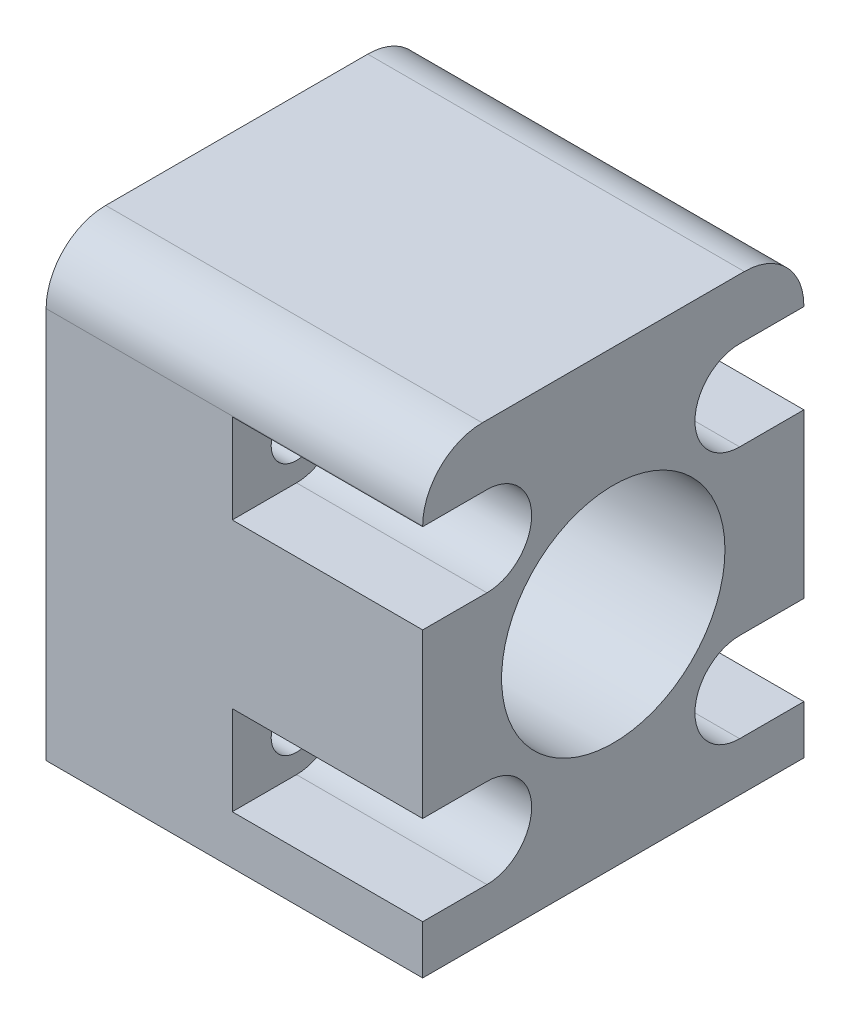
ISO-10303-21;
HEADER;
FILE_DESCRIPTION(('STEP AP214'),'2;1');
FILE_NAME('part.step','',(''),(''),'','','');
FILE_SCHEMA(('AUTOMOTIVE_DESIGN { 1 0 10303 214 1 1 1 1 }'));
ENDSEC;
DATA;
#1=APPLICATION_CONTEXT('core data for automotive mechanical design processes');
#2=APPLICATION_PROTOCOL_DEFINITION('international standard','automotive_design',2000,#1);
#3=PRODUCT_CONTEXT('',#1,'mechanical');
#4=PRODUCT('Part','Part','',(#3));
#5=PRODUCT_RELATED_PRODUCT_CATEGORY('part','',(#4));
#6=PRODUCT_DEFINITION_FORMATION('','',#4);
#7=PRODUCT_DEFINITION_CONTEXT('part definition',#1,'design');
#8=PRODUCT_DEFINITION('design','',#6,#7);
#9=PRODUCT_DEFINITION_SHAPE('','',#8);
#10=(LENGTH_UNIT() NAMED_UNIT(*) SI_UNIT(.MILLI.,.METRE.));
#11=(NAMED_UNIT(*) PLANE_ANGLE_UNIT() SI_UNIT($,.RADIAN.));
#12=(NAMED_UNIT(*) SI_UNIT($,.STERADIAN.) SOLID_ANGLE_UNIT());
#13=UNCERTAINTY_MEASURE_WITH_UNIT(LENGTH_MEASURE(1.E-05),#10,'distance_accuracy_value','');
#14=(GEOMETRIC_REPRESENTATION_CONTEXT(3) GLOBAL_UNCERTAINTY_ASSIGNED_CONTEXT((#13)) GLOBAL_UNIT_ASSIGNED_CONTEXT((#10,
#11,#12)) REPRESENTATION_CONTEXT('',''));
#15=CARTESIAN_POINT('',(0.,0.,0.));
#16=DIRECTION('',(0.,0.,1.));
#17=DIRECTION('',(1.,0.,0.));
#18=AXIS2_PLACEMENT_3D('',#15,#16,#17);
#19=CARTESIAN_POINT('',(0.,0.,25.6));
#20=DIRECTION('',(0.,0.,1.));
#21=DIRECTION('',(1.,0.,0.));
#22=AXIS2_PLACEMENT_3D('',#19,#20,#21);
#23=PLANE('',#22);
#24=DIRECTION('',(1.,0.,0.));
#25=VECTOR('',#24,1.);
#26=CARTESIAN_POINT('',(0.,-28.1822116803919,25.6));
#27=LINE('',#26,#25);
#28=CARTESIAN_POINT('',(61.7669675202535,-28.1822116803919,25.6));
#29=VERTEX_POINT('',#28);
#30=CARTESIAN_POINT('',(87.0552799456925,-28.1822116803919,25.6));
#31=VERTEX_POINT('',#30);
#32=EDGE_CURVE('E201',#29,#31,#27,.T.);
#33=ORIENTED_EDGE('',*,*,#32,.T.);
#34=DIRECTION('',(0.,1.,0.));
#35=VECTOR('',#34,1.);
#36=CARTESIAN_POINT('',(87.0552799456925,0.,25.6));
#37=LINE('',#36,#35);
#38=CARTESIAN_POINT('',(87.0552799456925,-24.9074927035347,25.6));
#39=VERTEX_POINT('',#38);
#40=EDGE_CURVE('E47',#31,#39,#37,.T.);
#41=ORIENTED_EDGE('',*,*,#40,.T.);
#42=DIRECTION('',(-1.,0.,0.));
#43=VECTOR('',#42,1.);
#44=CARTESIAN_POINT('',(0.,-24.9074927035347,25.6));
#45=LINE('',#44,#43);
#46=CARTESIAN_POINT('',(74.2669675202535,-24.9074927035347,25.6));
#47=VERTEX_POINT('',#46);
#48=EDGE_CURVE('E352',#39,#47,#45,.T.);
#49=ORIENTED_EDGE('',*,*,#48,.T.);
#50=DIRECTION('',(0.,-1.,0.));
#51=VECTOR('',#50,1.);
#52=CARTESIAN_POINT('',(74.2669675202535,0.,25.6));
#53=LINE('',#52,#51);
#54=CARTESIAN_POINT('',(74.2669675202535,-18.9074927035347,25.6));
#55=VERTEX_POINT('',#54);
#56=EDGE_CURVE('E259',#55,#47,#53,.T.);
#57=ORIENTED_EDGE('',*,*,#56,.F.);
#58=DIRECTION('',(1.,0.,0.));
#59=VECTOR('',#58,1.);
#60=CARTESIAN_POINT('',(0.,-18.9074927035347,25.6));
#61=LINE('',#60,#59);
#62=CARTESIAN_POINT('',(87.0552799456925,-18.9074927035347,25.6));
#63=VERTEX_POINT('',#62);
#64=EDGE_CURVE('E347',#55,#63,#61,.T.);
#65=ORIENTED_EDGE('',*,*,#64,.T.);
#66=CARTESIAN_POINT('',(87.0552799456925,-7.93692995505755,25.6));
#67=VERTEX_POINT('',#66);
#68=EDGE_CURVE('E401',#63,#67,#37,.T.);
#69=ORIENTED_EDGE('',*,*,#68,.T.);
#70=DIRECTION('',(-1.,0.,0.));
#71=VECTOR('',#70,1.);
#72=CARTESIAN_POINT('',(0.,-7.93692995505755,25.6));
#73=LINE('',#72,#71);
#74=CARTESIAN_POINT('',(74.2669675202535,-7.93692995505755,25.6));
#75=VERTEX_POINT('',#74);
#76=EDGE_CURVE('E345',#67,#75,#73,.T.);
#77=ORIENTED_EDGE('',*,*,#76,.T.);
#78=DIRECTION('',(0.,-1.,0.));
#79=VECTOR('',#78,1.);
#80=CARTESIAN_POINT('',(74.2669675202535,0.,25.6));
#81=LINE('',#80,#79);
#82=CARTESIAN_POINT('',(74.2669675202535,-1.93692995505755,25.6));
#83=VERTEX_POINT('',#82);
#84=EDGE_CURVE('E277',#83,#75,#81,.T.);
#85=ORIENTED_EDGE('',*,*,#84,.F.);
#86=DIRECTION('',(1.,0.,0.));
#87=VECTOR('',#86,1.);
#88=CARTESIAN_POINT('',(0.,-1.93692995505755,25.6));
#89=LINE('',#88,#87);
#90=CARTESIAN_POINT('',(87.0552799456925,-1.93692995505755,25.6));
#91=VERTEX_POINT('',#90);
#92=EDGE_CURVE('E330',#83,#91,#89,.T.);
#93=ORIENTED_EDGE('',*,*,#92,.T.);
#94=CARTESIAN_POINT('',(87.0552799456925,-1.89389925495292,25.6));
#95=VERTEX_POINT('',#94);
#96=EDGE_CURVE('E420',#91,#95,#37,.T.);
#97=ORIENTED_EDGE('',*,*,#96,.T.);
#98=DIRECTION('',(-1.,0.,0.));
#99=VECTOR('',#98,1.);
#100=CARTESIAN_POINT('',(61.7669675202535,-1.89389925495292,25.6));
#101=LINE('',#100,#99);
#102=CARTESIAN_POINT('',(61.7669675202535,-1.89389925495292,25.6));
#103=VERTEX_POINT('',#102);
#104=EDGE_CURVE('E317',#95,#103,#101,.T.);
#105=ORIENTED_EDGE('',*,*,#104,.T.);
#106=DIRECTION('',(0.,-1.,0.));
#107=VECTOR('',#106,1.);
#108=CARTESIAN_POINT('',(61.7669675202535,2.10610074504708,25.6));
#109=LINE('',#108,#107);
#110=EDGE_CURVE('E310',#103,#29,#109,.T.);
#111=ORIENTED_EDGE('',*,*,#110,.T.);
#112=EDGE_LOOP('',(#33,#41,#49,#57,#65,#69,#77,#85,#93,#97,#105,#111));
#113=FACE_BOUND('',#112,.T.);
#114=ADVANCED_FACE('F32',(#113),#23,.T.);
#115=CARTESIAN_POINT('',(0.,0.,0.));
#116=DIRECTION('',(0.,0.,1.));
#117=DIRECTION('',(1.,0.,0.));
#118=AXIS2_PLACEMENT_3D('',#115,#116,#117);
#119=PLANE('',#118);
#120=DIRECTION('',(0.,1.,0.));
#121=VECTOR('',#120,1.);
#122=CARTESIAN_POINT('',(87.0552799456925,0.,0.));
#123=LINE('',#122,#121);
#124=CARTESIAN_POINT('',(87.0552799456925,-28.1822116803919,0.));
#125=VERTEX_POINT('',#124);
#126=CARTESIAN_POINT('',(87.0552799456925,-24.9074927035347,0.));
#127=VERTEX_POINT('',#126);
#128=EDGE_CURVE('E182',#125,#127,#123,.T.);
#129=ORIENTED_EDGE('',*,*,#128,.F.);
#130=DIRECTION('',(1.,0.,0.));
#131=VECTOR('',#130,1.);
#132=CARTESIAN_POINT('',(0.,-28.1822116803919,0.));
#133=LINE('',#132,#131);
#134=CARTESIAN_POINT('',(61.7669675202535,-28.1822116803919,0.));
#135=VERTEX_POINT('',#134);
#136=EDGE_CURVE('E192',#135,#125,#133,.T.);
#137=ORIENTED_EDGE('',*,*,#136,.F.);
#138=DIRECTION('',(0.,-1.,0.));
#139=VECTOR('',#138,1.);
#140=CARTESIAN_POINT('',(61.7669675202535,2.10610074504708,0.));
#141=LINE('',#140,#139);
#142=CARTESIAN_POINT('',(61.7669675202535,-1.89389925495292,0.));
#143=VERTEX_POINT('',#142);
#144=EDGE_CURVE('E309',#143,#135,#141,.T.);
#145=ORIENTED_EDGE('',*,*,#144,.F.);
#146=DIRECTION('',(-1.,0.,0.));
#147=VECTOR('',#146,1.);
#148=CARTESIAN_POINT('',(0.,-1.89389925495292,0.));
#149=LINE('',#148,#147);
#150=CARTESIAN_POINT('',(87.0552799456925,-1.89389925495292,0.));
#151=VERTEX_POINT('',#150);
#152=EDGE_CURVE('E327',#143,#151,#149,.F.);
#153=ORIENTED_EDGE('',*,*,#152,.T.);
#154=CARTESIAN_POINT('',(87.0552799456925,-1.93692995505755,0.));
#155=VERTEX_POINT('',#154);
#156=EDGE_CURVE('E196',#155,#151,#123,.T.);
#157=ORIENTED_EDGE('',*,*,#156,.F.);
#158=DIRECTION('',(1.,0.,0.));
#159=VECTOR('',#158,1.);
#160=CARTESIAN_POINT('',(0.,-1.93692995505755,0.));
#161=LINE('',#160,#159);
#162=CARTESIAN_POINT('',(74.2669675202535,-1.93692995505755,0.));
#163=VERTEX_POINT('',#162);
#164=EDGE_CURVE('E354',#163,#155,#161,.T.);
#165=ORIENTED_EDGE('',*,*,#164,.F.);
#166=DIRECTION('',(0.,-1.,0.));
#167=VECTOR('',#166,1.);
#168=CARTESIAN_POINT('',(74.2669675202535,0.,0.));
#169=LINE('',#168,#167);
#170=CARTESIAN_POINT('',(74.2669675202535,-7.93692995505755,0.));
#171=VERTEX_POINT('',#170);
#172=EDGE_CURVE('E241',#163,#171,#169,.T.);
#173=ORIENTED_EDGE('',*,*,#172,.T.);
#174=DIRECTION('',(-1.,0.,0.));
#175=VECTOR('',#174,1.);
#176=CARTESIAN_POINT('',(0.,-7.93692995505755,0.));
#177=LINE('',#176,#175);
#178=CARTESIAN_POINT('',(87.0552799456925,-7.93692995505755,0.));
#179=VERTEX_POINT('',#178);
#180=EDGE_CURVE('E359',#179,#171,#177,.T.);
#181=ORIENTED_EDGE('',*,*,#180,.F.);
#182=CARTESIAN_POINT('',(87.0552799456925,-18.9074927035347,0.));
#183=VERTEX_POINT('',#182);
#184=EDGE_CURVE('E197',#183,#179,#123,.T.);
#185=ORIENTED_EDGE('',*,*,#184,.F.);
#186=DIRECTION('',(1.,0.,0.));
#187=VECTOR('',#186,1.);
#188=CARTESIAN_POINT('',(0.,-18.9074927035347,0.));
#189=LINE('',#188,#187);
#190=CARTESIAN_POINT('',(74.2669675202535,-18.9074927035347,0.));
#191=VERTEX_POINT('',#190);
#192=EDGE_CURVE('E361',#191,#183,#189,.T.);
#193=ORIENTED_EDGE('',*,*,#192,.F.);
#194=DIRECTION('',(0.,-1.,0.));
#195=VECTOR('',#194,1.);
#196=CARTESIAN_POINT('',(74.2669675202535,0.,0.));
#197=LINE('',#196,#195);
#198=CARTESIAN_POINT('',(74.2669675202535,-24.9074927035347,0.));
#199=VERTEX_POINT('',#198);
#200=EDGE_CURVE('E225',#191,#199,#197,.T.);
#201=ORIENTED_EDGE('',*,*,#200,.T.);
#202=DIRECTION('',(-1.,0.,0.));
#203=VECTOR('',#202,1.);
#204=CARTESIAN_POINT('',(0.,-24.9074927035347,0.));
#205=LINE('',#204,#203);
#206=EDGE_CURVE('E40',#127,#199,#205,.T.);
#207=ORIENTED_EDGE('',*,*,#206,.F.);
#208=EDGE_LOOP('',(#129,#137,#145,#153,#157,#165,#173,#181,#185,#193,#201,#207));
#209=FACE_BOUND('',#208,.T.);
#210=ADVANCED_FACE('F190',(#209),#119,.F.);
#211=CARTESIAN_POINT('',(61.7669675202535,2.10610074504708,25.6));
#212=DIRECTION('',(0.,-1.,0.));
#213=DIRECTION('',(0.,0.,-1.));
#214=AXIS2_PLACEMENT_3D('',#211,#212,#213);
#215=PLANE('',#214);
#216=DIRECTION('',(0.,0.,1.));
#217=VECTOR('',#216,1.);
#218=CARTESIAN_POINT('',(87.0552799456925,2.10610074504708,25.6));
#219=LINE('',#218,#217);
#220=CARTESIAN_POINT('',(87.0552799456925,2.10610074504708,4.));
#221=VERTEX_POINT('',#220);
#222=CARTESIAN_POINT('',(87.0552799456925,2.10610074504708,21.6));
#223=VERTEX_POINT('',#222);
#224=EDGE_CURVE('E206',#221,#223,#219,.T.);
#225=ORIENTED_EDGE('',*,*,#224,.F.);
#226=DIRECTION('',(-1.,0.,0.));
#227=VECTOR('',#226,1.);
#228=CARTESIAN_POINT('',(61.7669675202535,2.10610074504708,4.));
#229=LINE('',#228,#227);
#230=CARTESIAN_POINT('',(61.7669675202535,2.10610074504708,4.));
#231=VERTEX_POINT('',#230);
#232=EDGE_CURVE('E54',#221,#231,#229,.T.);
#233=ORIENTED_EDGE('',*,*,#232,.T.);
#234=DIRECTION('',(0.,0.,-1.));
#235=VECTOR('',#234,1.);
#236=CARTESIAN_POINT('',(61.7669675202535,2.10610074504708,25.6));
#237=LINE('',#236,#235);
#238=CARTESIAN_POINT('',(61.7669675202535,2.10610074504708,21.6));
#239=VERTEX_POINT('',#238);
#240=EDGE_CURVE('E313',#239,#231,#237,.T.);
#241=ORIENTED_EDGE('',*,*,#240,.F.);
#242=DIRECTION('',(-1.,0.,0.));
#243=VECTOR('',#242,1.);
#244=CARTESIAN_POINT('',(120.766967520254,2.10610074504708,21.6));
#245=LINE('',#244,#243);
#246=EDGE_CURVE('E324',#239,#223,#245,.F.);
#247=ORIENTED_EDGE('',*,*,#246,.T.);
#248=EDGE_LOOP('',(#225,#233,#241,#247));
#249=FACE_BOUND('',#248,.T.);
#250=ADVANCED_FACE('F428',(#249),#215,.F.);
#251=CARTESIAN_POINT('',(115.766967520254,-13.4222113292961,12.8));
#252=DIRECTION('',(1.,0.,0.));
#253=DIRECTION('',(0.,0.,-1.));
#254=AXIS2_PLACEMENT_3D('',#251,#252,#253);
#255=CYLINDRICAL_SURFACE('',#254,7.50000000000001);
#256=CARTESIAN_POINT('',(61.7669675202535,-13.4222113292961,12.8));
#257=DIRECTION('',(1.,0.,0.));
#258=DIRECTION('',(0.,0.,-1.));
#259=AXIS2_PLACEMENT_3D('',#256,#257,#258);
#260=CIRCLE('',#259,7.50000000000001);
#261=CARTESIAN_POINT('',(61.7669675202535,-13.4222113292961,5.29999999999999));
#262=VERTEX_POINT('',#261);
#263=EDGE_CURVE('E304',#262,#262,#260,.T.);
#264=ORIENTED_EDGE('',*,*,#263,.F.);
#265=EDGE_LOOP('',(#264));
#266=FACE_BOUND('',#265,.T.);
#267=CARTESIAN_POINT('',(87.0552799456925,-13.4222113292961,12.8));
#268=DIRECTION('',(1.,0.,0.));
#269=DIRECTION('',(0.,0.,-1.));
#270=AXIS2_PLACEMENT_3D('',#267,#268,#269);
#271=CIRCLE('',#270,7.50000000000001);
#272=CARTESIAN_POINT('',(87.0552799456925,-13.4222113292961,5.29999999999999));
#273=VERTEX_POINT('',#272);
#274=EDGE_CURVE('E202',#273,#273,#271,.F.);
#275=ORIENTED_EDGE('',*,*,#274,.F.);
#276=EDGE_LOOP('',(#275));
#277=FACE_BOUND('',#276,.T.);
#278=ADVANCED_FACE('F483',(#266,#277),#255,.F.);
#279=CARTESIAN_POINT('',(0.,-1.89389925495292,21.6));
#280=DIRECTION('',(1.,0.,0.));
#281=DIRECTION('',(0.,0.,-1.));
#282=AXIS2_PLACEMENT_3D('',#279,#280,#281);
#283=CYLINDRICAL_SURFACE('',#282,4.);
#284=ORIENTED_EDGE('',*,*,#104,.F.);
#285=CARTESIAN_POINT('',(87.0552799456925,-1.89389925495292,21.6));
#286=DIRECTION('',(1.,0.,0.));
#287=DIRECTION('',(0.,0.,-1.));
#288=AXIS2_PLACEMENT_3D('',#285,#286,#287);
#289=CIRCLE('',#288,4.);
#290=EDGE_CURVE('E419',#95,#223,#289,.F.);
#291=ORIENTED_EDGE('',*,*,#290,.T.);
#292=ORIENTED_EDGE('',*,*,#246,.F.);
#293=CARTESIAN_POINT('',(61.7669675202535,-1.89389925495292,21.6));
#294=DIRECTION('',(1.,0.,0.));
#295=DIRECTION('',(0.,0.,-1.));
#296=AXIS2_PLACEMENT_3D('',#293,#294,#295);
#297=CIRCLE('',#296,4.);
#298=EDGE_CURVE('E321',#103,#239,#297,.F.);
#299=ORIENTED_EDGE('',*,*,#298,.F.);
#300=EDGE_LOOP('',(#284,#291,#292,#299));
#301=FACE_BOUND('',#300,.T.);
#302=ADVANCED_FACE('F426',(#301),#283,.T.);
#303=CARTESIAN_POINT('',(61.7669675202535,-1.89389925495292,4.));
#304=DIRECTION('',(-1.,0.,0.));
#305=DIRECTION('',(0.,0.,1.));
#306=AXIS2_PLACEMENT_3D('',#303,#304,#305);
#307=CYLINDRICAL_SURFACE('',#306,4.);
#308=ORIENTED_EDGE('',*,*,#232,.F.);
#309=CARTESIAN_POINT('',(87.0552799456925,-1.89389925495292,4.));
#310=DIRECTION('',(1.,0.,0.));
#311=DIRECTION('',(0.,0.,-1.));
#312=AXIS2_PLACEMENT_3D('',#309,#310,#311);
#313=CIRCLE('',#312,4.);
#314=EDGE_CURVE('E416',#221,#151,#313,.F.);
#315=ORIENTED_EDGE('',*,*,#314,.T.);
#316=ORIENTED_EDGE('',*,*,#152,.F.);
#317=CARTESIAN_POINT('',(61.7669675202535,-1.89389925495292,4.));
#318=DIRECTION('',(1.,0.,0.));
#319=DIRECTION('',(0.,0.,-1.));
#320=AXIS2_PLACEMENT_3D('',#317,#318,#319);
#321=CIRCLE('',#320,4.);
#322=EDGE_CURVE('E319',#231,#143,#321,.F.);
#323=ORIENTED_EDGE('',*,*,#322,.F.);
#324=EDGE_LOOP('',(#308,#315,#316,#323));
#325=FACE_BOUND('',#324,.T.);
#326=ADVANCED_FACE('F34',(#325),#307,.T.);
#327=CARTESIAN_POINT('',(74.2669675202535,-4.93692995505755,21.2852813742386));
#328=DIRECTION('',(1.,0.,0.));
#329=DIRECTION('',(0.,0.,-1.));
#330=AXIS2_PLACEMENT_3D('',#327,#328,#329);
#331=CYLINDRICAL_SURFACE('',#330,3.);
#332=DIRECTION('',(1.,0.,0.));
#333=VECTOR('',#332,1.);
#334=CARTESIAN_POINT('',(74.2669675202535,-7.93692995505755,21.2852813742386));
#335=LINE('',#334,#333);
#336=CARTESIAN_POINT('',(74.2669675202535,-7.93692995505755,21.2852813742386));
#337=VERTEX_POINT('',#336);
#338=CARTESIAN_POINT('',(87.0552799456925,-7.93692995505755,21.2852813742386));
#339=VERTEX_POINT('',#338);
#340=EDGE_CURVE('E273',#337,#339,#335,.T.);
#341=ORIENTED_EDGE('',*,*,#340,.T.);
#342=CARTESIAN_POINT('',(87.0552799456925,-4.93692995505755,21.2852813742386));
#343=DIRECTION('',(1.,0.,0.));
#344=DIRECTION('',(0.,0.,-1.));
#345=AXIS2_PLACEMENT_3D('',#342,#343,#344);
#346=CIRCLE('',#345,3.);
#347=CARTESIAN_POINT('',(87.0552799456925,-1.93692995505755,21.2852813742386));
#348=VERTEX_POINT('',#347);
#349=EDGE_CURVE('E404',#339,#348,#346,.T.);
#350=ORIENTED_EDGE('',*,*,#349,.T.);
#351=DIRECTION('',(1.,0.,0.));
#352=VECTOR('',#351,1.);
#353=CARTESIAN_POINT('',(74.2669675202535,-1.93692995505755,21.2852813742386));
#354=LINE('',#353,#352);
#355=CARTESIAN_POINT('',(74.2669675202535,-1.93692995505755,21.2852813742386));
#356=VERTEX_POINT('',#355);
#357=EDGE_CURVE('E270',#356,#348,#354,.T.);
#358=ORIENTED_EDGE('',*,*,#357,.F.);
#359=CARTESIAN_POINT('',(74.2669675202535,-4.93692995505755,21.2852813742386));
#360=DIRECTION('',(-1.,0.,0.));
#361=DIRECTION('',(0.,0.,1.));
#362=AXIS2_PLACEMENT_3D('',#359,#360,#361);
#363=CIRCLE('',#362,3.);
#364=EDGE_CURVE('E262',#356,#337,#363,.T.);
#365=ORIENTED_EDGE('',*,*,#364,.T.);
#366=EDGE_LOOP('',(#341,#350,#358,#365));
#367=FACE_BOUND('',#366,.T.);
#368=ADVANCED_FACE('F458',(#367),#331,.F.);
#369=CARTESIAN_POINT('',(74.2669675202535,-7.93692995505755,21.2852813742386));
#370=DIRECTION('',(0.,1.,0.));
#371=DIRECTION('',(0.,0.,1.));
#372=AXIS2_PLACEMENT_3D('',#369,#370,#371);
#373=PLANE('',#372);
#374=ORIENTED_EDGE('',*,*,#76,.F.);
#375=DIRECTION('',(0.,0.,-1.));
#376=VECTOR('',#375,1.);
#377=CARTESIAN_POINT('',(87.0552799456925,-7.93692995505755,21.2852813742386));
#378=LINE('',#377,#376);
#379=EDGE_CURVE('E400',#67,#339,#378,.T.);
#380=ORIENTED_EDGE('',*,*,#379,.T.);
#381=ORIENTED_EDGE('',*,*,#340,.F.);
#382=DIRECTION('',(0.,0.,1.));
#383=VECTOR('',#382,1.);
#384=CARTESIAN_POINT('',(74.2669675202535,-7.93692995505755,21.2852813742386));
#385=LINE('',#384,#383);
#386=EDGE_CURVE('E265',#337,#75,#385,.T.);
#387=ORIENTED_EDGE('',*,*,#386,.T.);
#388=EDGE_LOOP('',(#374,#380,#381,#387));
#389=FACE_BOUND('',#388,.T.);
#390=ADVANCED_FACE('F456',(#389),#373,.T.);
#391=CARTESIAN_POINT('',(74.2669675202535,-1.93692995505755,21.2852813742386));
#392=DIRECTION('',(0.,-1.,0.));
#393=DIRECTION('',(0.,0.,-1.));
#394=AXIS2_PLACEMENT_3D('',#391,#392,#393);
#395=PLANE('',#394);
#396=ORIENTED_EDGE('',*,*,#357,.T.);
#397=DIRECTION('',(0.,0.,1.));
#398=VECTOR('',#397,1.);
#399=CARTESIAN_POINT('',(87.0552799456925,-1.93692995505755,21.2852813742386));
#400=LINE('',#399,#398);
#401=EDGE_CURVE('E413',#348,#91,#400,.T.);
#402=ORIENTED_EDGE('',*,*,#401,.T.);
#403=ORIENTED_EDGE('',*,*,#92,.F.);
#404=DIRECTION('',(0.,0.,-1.));
#405=VECTOR('',#404,1.);
#406=CARTESIAN_POINT('',(74.2669675202535,-1.93692995505755,21.2852813742386));
#407=LINE('',#406,#405);
#408=EDGE_CURVE('E268',#83,#356,#407,.T.);
#409=ORIENTED_EDGE('',*,*,#408,.T.);
#410=EDGE_LOOP('',(#396,#402,#403,#409));
#411=FACE_BOUND('',#410,.T.);
#412=ADVANCED_FACE('F466',(#411),#395,.T.);
#413=CARTESIAN_POINT('',(74.2669675202535,-21.9074927035347,21.2852813742386));
#414=DIRECTION('',(1.,0.,0.));
#415=DIRECTION('',(0.,0.,-1.));
#416=AXIS2_PLACEMENT_3D('',#413,#414,#415);
#417=CYLINDRICAL_SURFACE('',#416,3.);
#418=DIRECTION('',(1.,0.,0.));
#419=VECTOR('',#418,1.);
#420=CARTESIAN_POINT('',(74.2669675202535,-24.9074927035347,21.2852813742386));
#421=LINE('',#420,#419);
#422=CARTESIAN_POINT('',(74.2669675202535,-24.9074927035347,21.2852813742386));
#423=VERTEX_POINT('',#422);
#424=CARTESIAN_POINT('',(87.0552799456925,-24.9074927035347,21.2852813742386));
#425=VERTEX_POINT('',#424);
#426=EDGE_CURVE('E255',#423,#425,#421,.T.);
#427=ORIENTED_EDGE('',*,*,#426,.T.);
#428=CARTESIAN_POINT('',(87.0552799456925,-21.9074927035347,21.2852813742386));
#429=DIRECTION('',(1.,0.,0.));
#430=DIRECTION('',(0.,0.,-1.));
#431=AXIS2_PLACEMENT_3D('',#428,#429,#430);
#432=CIRCLE('',#431,3.);
#433=CARTESIAN_POINT('',(87.0552799456925,-18.9074927035347,21.2852813742386));
#434=VERTEX_POINT('',#433);
#435=EDGE_CURVE('E386',#425,#434,#432,.T.);
#436=ORIENTED_EDGE('',*,*,#435,.T.);
#437=DIRECTION('',(1.,0.,0.));
#438=VECTOR('',#437,1.);
#439=CARTESIAN_POINT('',(74.2669675202535,-18.9074927035347,21.2852813742386));
#440=LINE('',#439,#438);
#441=CARTESIAN_POINT('',(74.2669675202535,-18.9074927035347,21.2852813742386));
#442=VERTEX_POINT('',#441);
#443=EDGE_CURVE('E252',#442,#434,#440,.T.);
#444=ORIENTED_EDGE('',*,*,#443,.F.);
#445=CARTESIAN_POINT('',(74.2669675202535,-21.9074927035347,21.2852813742386));
#446=DIRECTION('',(-1.,0.,0.));
#447=DIRECTION('',(0.,0.,1.));
#448=AXIS2_PLACEMENT_3D('',#445,#446,#447);
#449=CIRCLE('',#448,3.);
#450=EDGE_CURVE('E244',#442,#423,#449,.T.);
#451=ORIENTED_EDGE('',*,*,#450,.T.);
#452=EDGE_LOOP('',(#427,#436,#444,#451));
#453=FACE_BOUND('',#452,.T.);
#454=ADVANCED_FACE('F443',(#453),#417,.F.);
#455=CARTESIAN_POINT('',(74.2669675202535,-24.9074927035347,21.2852813742386));
#456=DIRECTION('',(0.,1.,0.));
#457=DIRECTION('',(0.,0.,1.));
#458=AXIS2_PLACEMENT_3D('',#455,#456,#457);
#459=PLANE('',#458);
#460=ORIENTED_EDGE('',*,*,#48,.F.);
#461=DIRECTION('',(0.,0.,-1.));
#462=VECTOR('',#461,1.);
#463=CARTESIAN_POINT('',(87.0552799456925,-24.9074927035347,21.2852813742386));
#464=LINE('',#463,#462);
#465=EDGE_CURVE('E391',#39,#425,#464,.T.);
#466=ORIENTED_EDGE('',*,*,#465,.T.);
#467=ORIENTED_EDGE('',*,*,#426,.F.);
#468=DIRECTION('',(0.,0.,1.));
#469=VECTOR('',#468,1.);
#470=CARTESIAN_POINT('',(74.2669675202535,-24.9074927035347,21.2852813742386));
#471=LINE('',#470,#469);
#472=EDGE_CURVE('E247',#423,#47,#471,.T.);
#473=ORIENTED_EDGE('',*,*,#472,.T.);
#474=EDGE_LOOP('',(#460,#466,#467,#473));
#475=FACE_BOUND('',#474,.T.);
#476=ADVANCED_FACE('F441',(#475),#459,.T.);
#477=CARTESIAN_POINT('',(74.2669675202535,-18.9074927035347,21.2852813742386));
#478=DIRECTION('',(0.,-1.,0.));
#479=DIRECTION('',(0.,0.,-1.));
#480=AXIS2_PLACEMENT_3D('',#477,#478,#479);
#481=PLANE('',#480);
#482=ORIENTED_EDGE('',*,*,#443,.T.);
#483=DIRECTION('',(0.,0.,1.));
#484=VECTOR('',#483,1.);
#485=CARTESIAN_POINT('',(87.0552799456925,-18.9074927035347,21.2852813742386));
#486=LINE('',#485,#484);
#487=EDGE_CURVE('E388',#434,#63,#486,.T.);
#488=ORIENTED_EDGE('',*,*,#487,.T.);
#489=ORIENTED_EDGE('',*,*,#64,.F.);
#490=DIRECTION('',(0.,0.,-1.));
#491=VECTOR('',#490,1.);
#492=CARTESIAN_POINT('',(74.2669675202535,-18.9074927035347,21.2852813742386));
#493=LINE('',#492,#491);
#494=EDGE_CURVE('E250',#55,#442,#493,.T.);
#495=ORIENTED_EDGE('',*,*,#494,.T.);
#496=EDGE_LOOP('',(#482,#488,#489,#495));
#497=FACE_BOUND('',#496,.T.);
#498=ADVANCED_FACE('F453',(#497),#481,.T.);
#499=CARTESIAN_POINT('',(74.2669675202535,-7.93692995505755,-3.68528137423857));
#500=DIRECTION('',(0.,1.,0.));
#501=DIRECTION('',(0.,0.,1.));
#502=AXIS2_PLACEMENT_3D('',#499,#500,#501);
#503=PLANE('',#502);
#504=DIRECTION('',(1.,0.,0.));
#505=VECTOR('',#504,1.);
#506=CARTESIAN_POINT('',(74.2669675202535,-7.93692995505755,4.31471862576144));
#507=LINE('',#506,#505);
#508=CARTESIAN_POINT('',(74.2669675202535,-7.93692995505755,4.31471862576144));
#509=VERTEX_POINT('',#508);
#510=CARTESIAN_POINT('',(87.0552799456925,-7.93692995505755,4.31471862576144));
#511=VERTEX_POINT('',#510);
#512=EDGE_CURVE('E237',#509,#511,#507,.T.);
#513=ORIENTED_EDGE('',*,*,#512,.T.);
#514=DIRECTION('',(0.,0.,-1.));
#515=VECTOR('',#514,1.);
#516=CARTESIAN_POINT('',(87.0552799456925,-7.93692995505755,-3.68528137423857));
#517=LINE('',#516,#515);
#518=EDGE_CURVE('E397',#511,#179,#517,.T.);
#519=ORIENTED_EDGE('',*,*,#518,.T.);
#520=ORIENTED_EDGE('',*,*,#180,.T.);
#521=DIRECTION('',(0.,0.,1.));
#522=VECTOR('',#521,1.);
#523=CARTESIAN_POINT('',(74.2669675202535,-7.93692995505755,-3.68528137423857));
#524=LINE('',#523,#522);
#525=EDGE_CURVE('E227',#171,#509,#524,.T.);
#526=ORIENTED_EDGE('',*,*,#525,.T.);
#527=EDGE_LOOP('',(#513,#519,#520,#526));
#528=FACE_BOUND('',#527,.T.);
#529=ADVANCED_FACE('F527',(#528),#503,.T.);
#530=CARTESIAN_POINT('',(74.2669675202535,-1.93692995505755,-3.68528137423857));
#531=DIRECTION('',(0.,-1.,0.));
#532=DIRECTION('',(0.,0.,-1.));
#533=AXIS2_PLACEMENT_3D('',#530,#531,#532);
#534=PLANE('',#533);
#535=ORIENTED_EDGE('',*,*,#164,.T.);
#536=DIRECTION('',(0.,0.,1.));
#537=VECTOR('',#536,1.);
#538=CARTESIAN_POINT('',(87.0552799456925,-1.93692995505755,-3.68528137423857));
#539=LINE('',#538,#537);
#540=CARTESIAN_POINT('',(87.0552799456925,-1.93692995505755,4.31471862576144));
#541=VERTEX_POINT('',#540);
#542=EDGE_CURVE('E410',#155,#541,#539,.T.);
#543=ORIENTED_EDGE('',*,*,#542,.T.);
#544=DIRECTION('',(1.,0.,0.));
#545=VECTOR('',#544,1.);
#546=CARTESIAN_POINT('',(74.2669675202535,-1.93692995505755,4.31471862576144));
#547=LINE('',#546,#545);
#548=CARTESIAN_POINT('',(74.2669675202535,-1.93692995505755,4.31471862576144));
#549=VERTEX_POINT('',#548);
#550=EDGE_CURVE('E234',#549,#541,#547,.T.);
#551=ORIENTED_EDGE('',*,*,#550,.F.);
#552=DIRECTION('',(0.,0.,-1.));
#553=VECTOR('',#552,1.);
#554=CARTESIAN_POINT('',(74.2669675202535,-1.93692995505755,-3.68528137423857));
#555=LINE('',#554,#553);
#556=EDGE_CURVE('E231',#549,#163,#555,.T.);
#557=ORIENTED_EDGE('',*,*,#556,.T.);
#558=EDGE_LOOP('',(#535,#543,#551,#557));
#559=FACE_BOUND('',#558,.T.);
#560=ADVANCED_FACE('F524',(#559),#534,.T.);
#561=CARTESIAN_POINT('',(74.2669675202535,-4.93692995505755,4.31471862576144));
#562=DIRECTION('',(1.,0.,0.));
#563=DIRECTION('',(0.,0.,-1.));
#564=AXIS2_PLACEMENT_3D('',#561,#562,#563);
#565=CYLINDRICAL_SURFACE('',#564,3.);
#566=ORIENTED_EDGE('',*,*,#550,.T.);
#567=CARTESIAN_POINT('',(87.0552799456925,-4.93692995505755,4.31471862576144));
#568=DIRECTION('',(1.,0.,0.));
#569=DIRECTION('',(0.,0.,-1.));
#570=AXIS2_PLACEMENT_3D('',#567,#568,#569);
#571=CIRCLE('',#570,3.);
#572=EDGE_CURVE('E407',#541,#511,#571,.T.);
#573=ORIENTED_EDGE('',*,*,#572,.T.);
#574=ORIENTED_EDGE('',*,*,#512,.F.);
#575=CARTESIAN_POINT('',(74.2669675202535,-4.93692995505755,4.31471862576144));
#576=DIRECTION('',(-1.,0.,0.));
#577=DIRECTION('',(0.,0.,1.));
#578=AXIS2_PLACEMENT_3D('',#575,#576,#577);
#579=CIRCLE('',#578,3.);
#580=EDGE_CURVE('E229',#509,#549,#579,.T.);
#581=ORIENTED_EDGE('',*,*,#580,.T.);
#582=EDGE_LOOP('',(#566,#573,#574,#581));
#583=FACE_BOUND('',#582,.T.);
#584=ADVANCED_FACE('F520',(#583),#565,.F.);
#585=CARTESIAN_POINT('',(74.2669675202535,-24.9074927035347,-3.68528137423857));
#586=DIRECTION('',(0.,1.,0.));
#587=DIRECTION('',(0.,0.,1.));
#588=AXIS2_PLACEMENT_3D('',#585,#586,#587);
#589=PLANE('',#588);
#590=DIRECTION('',(1.,0.,0.));
#591=VECTOR('',#590,1.);
#592=CARTESIAN_POINT('',(74.2669675202535,-24.9074927035347,4.31471862576144));
#593=LINE('',#592,#591);
#594=CARTESIAN_POINT('',(74.2669675202535,-24.9074927035347,4.31471862576144));
#595=VERTEX_POINT('',#594);
#596=CARTESIAN_POINT('',(87.0552799456925,-24.9074927035347,4.31471862576144));
#597=VERTEX_POINT('',#596);
#598=EDGE_CURVE('E221',#595,#597,#593,.T.);
#599=ORIENTED_EDGE('',*,*,#598,.T.);
#600=DIRECTION('',(0.,0.,-1.));
#601=VECTOR('',#600,1.);
#602=CARTESIAN_POINT('',(87.0552799456925,-24.9074927035347,-3.68528137423857));
#603=LINE('',#602,#601);
#604=EDGE_CURVE('E369',#597,#127,#603,.T.);
#605=ORIENTED_EDGE('',*,*,#604,.T.);
#606=ORIENTED_EDGE('',*,*,#206,.T.);
#607=DIRECTION('',(0.,0.,1.));
#608=VECTOR('',#607,1.);
#609=CARTESIAN_POINT('',(74.2669675202535,-24.9074927035347,-3.68528137423857));
#610=LINE('',#609,#608);
#611=EDGE_CURVE('E211',#199,#595,#610,.T.);
#612=ORIENTED_EDGE('',*,*,#611,.T.);
#613=EDGE_LOOP('',(#599,#605,#606,#612));
#614=FACE_BOUND('',#613,.T.);
#615=ADVANCED_FACE('F367',(#614),#589,.T.);
#616=CARTESIAN_POINT('',(74.2669675202535,-18.9074927035347,-3.68528137423857));
#617=DIRECTION('',(0.,-1.,0.));
#618=DIRECTION('',(0.,0.,-1.));
#619=AXIS2_PLACEMENT_3D('',#616,#617,#618);
#620=PLANE('',#619);
#621=ORIENTED_EDGE('',*,*,#192,.T.);
#622=DIRECTION('',(0.,0.,1.));
#623=VECTOR('',#622,1.);
#624=CARTESIAN_POINT('',(87.0552799456925,-18.9074927035347,-3.68528137423857));
#625=LINE('',#624,#623);
#626=CARTESIAN_POINT('',(87.0552799456925,-18.9074927035347,4.31471862576144));
#627=VERTEX_POINT('',#626);
#628=EDGE_CURVE('E381',#183,#627,#625,.T.);
#629=ORIENTED_EDGE('',*,*,#628,.T.);
#630=DIRECTION('',(1.,0.,0.));
#631=VECTOR('',#630,1.);
#632=CARTESIAN_POINT('',(74.2669675202535,-18.9074927035347,4.31471862576144));
#633=LINE('',#632,#631);
#634=CARTESIAN_POINT('',(74.2669675202535,-18.9074927035347,4.31471862576144));
#635=VERTEX_POINT('',#634);
#636=EDGE_CURVE('E218',#635,#627,#633,.T.);
#637=ORIENTED_EDGE('',*,*,#636,.F.);
#638=DIRECTION('',(0.,0.,-1.));
#639=VECTOR('',#638,1.);
#640=CARTESIAN_POINT('',(74.2669675202535,-18.9074927035347,-3.68528137423857));
#641=LINE('',#640,#639);
#642=EDGE_CURVE('E215',#635,#191,#641,.T.);
#643=ORIENTED_EDGE('',*,*,#642,.T.);
#644=EDGE_LOOP('',(#621,#629,#637,#643));
#645=FACE_BOUND('',#644,.T.);
#646=ADVANCED_FACE('F379',(#645),#620,.T.);
#647=CARTESIAN_POINT('',(74.2669675202535,-21.9074927035347,4.31471862576144));
#648=DIRECTION('',(1.,0.,0.));
#649=DIRECTION('',(0.,0.,-1.));
#650=AXIS2_PLACEMENT_3D('',#647,#648,#649);
#651=CYLINDRICAL_SURFACE('',#650,3.);
#652=ORIENTED_EDGE('',*,*,#636,.T.);
#653=CARTESIAN_POINT('',(87.0552799456925,-21.9074927035347,4.31471862576144));
#654=DIRECTION('',(1.,0.,0.));
#655=DIRECTION('',(0.,0.,-1.));
#656=AXIS2_PLACEMENT_3D('',#653,#654,#655);
#657=CIRCLE('',#656,3.);
#658=EDGE_CURVE('E385',#627,#597,#657,.T.);
#659=ORIENTED_EDGE('',*,*,#658,.T.);
#660=ORIENTED_EDGE('',*,*,#598,.F.);
#661=CARTESIAN_POINT('',(74.2669675202535,-21.9074927035347,4.31471862576144));
#662=DIRECTION('',(-1.,0.,0.));
#663=DIRECTION('',(0.,0.,1.));
#664=AXIS2_PLACEMENT_3D('',#661,#662,#663);
#665=CIRCLE('',#664,3.);
#666=EDGE_CURVE('E213',#595,#635,#665,.T.);
#667=ORIENTED_EDGE('',*,*,#666,.T.);
#668=EDGE_LOOP('',(#652,#659,#660,#667));
#669=FACE_BOUND('',#668,.T.);
#670=ADVANCED_FACE('F384',(#669),#651,.F.);
#671=CARTESIAN_POINT('',(0.,-28.1822116803919,0.));
#672=DIRECTION('',(0.,-1.,0.));
#673=DIRECTION('',(0.,0.,-1.));
#674=AXIS2_PLACEMENT_3D('',#671,#672,#673);
#675=PLANE('',#674);
#676=ORIENTED_EDGE('',*,*,#136,.T.);
#677=DIRECTION('',(0.,0.,1.));
#678=VECTOR('',#677,1.);
#679=CARTESIAN_POINT('',(87.0552799456925,-28.1822116803919,0.));
#680=LINE('',#679,#678);
#681=EDGE_CURVE('E11',#125,#31,#680,.T.);
#682=ORIENTED_EDGE('',*,*,#681,.T.);
#683=ORIENTED_EDGE('',*,*,#32,.F.);
#684=DIRECTION('',(0.,0.,-1.));
#685=VECTOR('',#684,1.);
#686=CARTESIAN_POINT('',(61.7669675202535,-28.1822116803919,25.6));
#687=LINE('',#686,#685);
#688=EDGE_CURVE('E200',#29,#135,#687,.T.);
#689=ORIENTED_EDGE('',*,*,#688,.T.);
#690=EDGE_LOOP('',(#676,#682,#683,#689));
#691=FACE_BOUND('',#690,.T.);
#692=ADVANCED_FACE('F198',(#691),#675,.T.);
#693=CARTESIAN_POINT('',(61.7669675202535,2.10610074504708,25.6));
#694=DIRECTION('',(1.,0.,0.));
#695=DIRECTION('',(0.,0.,-1.));
#696=AXIS2_PLACEMENT_3D('',#693,#694,#695);
#697=PLANE('',#696);
#698=ORIENTED_EDGE('',*,*,#263,.T.);
#699=EDGE_LOOP('',(#698));
#700=FACE_BOUND('',#699,.T.);
#701=CARTESIAN_POINT('',(61.7669675202535,-4.93692995505755,21.2852813742386));
#702=DIRECTION('',(-1.,0.,0.));
#703=DIRECTION('',(0.,0.,1.));
#704=AXIS2_PLACEMENT_3D('',#701,#702,#703);
#705=CIRCLE('',#704,2.6);
#706=CARTESIAN_POINT('',(61.7669675202535,-4.93692995505755,23.8852813742386));
#707=VERTEX_POINT('',#706);
#708=EDGE_CURVE('E298',#707,#707,#705,.T.);
#709=ORIENTED_EDGE('',*,*,#708,.F.);
#710=EDGE_LOOP('',(#709));
#711=FACE_BOUND('',#710,.T.);
#712=CARTESIAN_POINT('',(61.7669675202535,-4.93692995505755,4.31471862576144));
#713=DIRECTION('',(-1.,0.,0.));
#714=DIRECTION('',(0.,0.,-1.));
#715=AXIS2_PLACEMENT_3D('',#712,#713,#714);
#716=CIRCLE('',#715,2.6);
#717=CARTESIAN_POINT('',(61.7669675202535,-4.93692995505755,1.71471862576144));
#718=VERTEX_POINT('',#717);
#719=EDGE_CURVE('E292',#718,#718,#716,.T.);
#720=ORIENTED_EDGE('',*,*,#719,.F.);
#721=EDGE_LOOP('',(#720));
#722=FACE_BOUND('',#721,.T.);
#723=CARTESIAN_POINT('',(61.7669675202535,-21.9074927035347,4.31471862576144));
#724=DIRECTION('',(-1.,0.,0.));
#725=DIRECTION('',(0.,0.,1.));
#726=AXIS2_PLACEMENT_3D('',#723,#724,#725);
#727=CIRCLE('',#726,2.6);
#728=CARTESIAN_POINT('',(61.7669675202535,-21.9074927035347,6.91471862576144));
#729=VERTEX_POINT('',#728);
#730=EDGE_CURVE('E284',#729,#729,#727,.T.);
#731=ORIENTED_EDGE('',*,*,#730,.F.);
#732=EDGE_LOOP('',(#731));
#733=FACE_BOUND('',#732,.T.);
#734=CARTESIAN_POINT('',(61.7669675202535,-21.9074927035347,21.2852813742386));
#735=DIRECTION('',(-1.,0.,0.));
#736=DIRECTION('',(0.,0.,-1.));
#737=AXIS2_PLACEMENT_3D('',#734,#735,#736);
#738=CIRCLE('',#737,2.6);
#739=CARTESIAN_POINT('',(61.7669675202535,-21.9074927035347,18.6852813742386));
#740=VERTEX_POINT('',#739);
#741=EDGE_CURVE('E285',#740,#740,#738,.T.);
#742=ORIENTED_EDGE('',*,*,#741,.F.);
#743=EDGE_LOOP('',(#742));
#744=FACE_BOUND('',#743,.T.);
#745=ORIENTED_EDGE('',*,*,#688,.F.);
#746=ORIENTED_EDGE('',*,*,#110,.F.);
#747=ORIENTED_EDGE('',*,*,#298,.T.);
#748=ORIENTED_EDGE('',*,*,#240,.T.);
#749=ORIENTED_EDGE('',*,*,#322,.T.);
#750=ORIENTED_EDGE('',*,*,#144,.T.);
#751=EDGE_LOOP('',(#745,#746,#747,#748,#749,#750));
#752=FACE_BOUND('',#751,.T.);
#753=ADVANCED_FACE('F430',(#700,#711,#722,#733,#744,#752),#697,.F.);
#754=CARTESIAN_POINT('',(66.7669675202535,-4.93692995505755,21.2852813742386));
#755=DIRECTION('',(-1.,0.,0.));
#756=DIRECTION('',(0.,0.,1.));
#757=AXIS2_PLACEMENT_3D('',#754,#755,#756);
#758=CYLINDRICAL_SURFACE('',#757,2.6);
#759=CARTESIAN_POINT('',(66.7669675202535,-4.93692995505755,21.2852813742386));
#760=DIRECTION('',(-1.,0.,0.));
#761=DIRECTION('',(0.,0.,1.));
#762=AXIS2_PLACEMENT_3D('',#759,#760,#761);
#763=CIRCLE('',#762,2.6);
#764=CARTESIAN_POINT('',(66.7669675202535,-4.93692995505755,23.8852813742386));
#765=VERTEX_POINT('',#764);
#766=EDGE_CURVE('E301',#765,#765,#763,.T.);
#767=ORIENTED_EDGE('',*,*,#766,.F.);
#768=EDGE_LOOP('',(#767));
#769=FACE_BOUND('',#768,.T.);
#770=ORIENTED_EDGE('',*,*,#708,.T.);
#771=EDGE_LOOP('',(#770));
#772=FACE_BOUND('',#771,.T.);
#773=ADVANCED_FACE('F489',(#769,#772),#758,.F.);
#774=CARTESIAN_POINT('',(66.7669675202535,-4.93692995505755,21.2852813742386));
#775=DIRECTION('',(-1.,0.,0.));
#776=DIRECTION('',(0.,0.,1.));
#777=AXIS2_PLACEMENT_3D('',#774,#775,#776);
#778=PLANE('',#777);
#779=CARTESIAN_POINT('',(66.7669675202535,-4.93692995505755,21.2852813742386));
#780=DIRECTION('',(-1.,0.,0.));
#781=DIRECTION('',(0.,0.,1.));
#782=AXIS2_PLACEMENT_3D('',#779,#780,#781);
#783=CIRCLE('',#782,1.7);
#784=CARTESIAN_POINT('',(66.7669675202535,-4.93692995505755,22.9852813742386));
#785=VERTEX_POINT('',#784);
#786=EDGE_CURVE('E288',#785,#785,#783,.T.);
#787=ORIENTED_EDGE('',*,*,#786,.F.);
#788=EDGE_LOOP('',(#787));
#789=FACE_BOUND('',#788,.T.);
#790=ORIENTED_EDGE('',*,*,#766,.T.);
#791=EDGE_LOOP('',(#790));
#792=FACE_BOUND('',#791,.T.);
#793=ADVANCED_FACE('F587',(#789,#792),#778,.T.);
#794=CARTESIAN_POINT('',(66.7669675202535,-4.93692995505755,4.31471862576144));
#795=DIRECTION('',(-1.,0.,0.));
#796=DIRECTION('',(0.,0.,1.));
#797=AXIS2_PLACEMENT_3D('',#794,#795,#796);
#798=CYLINDRICAL_SURFACE('',#797,2.6);
#799=CARTESIAN_POINT('',(66.7669675202535,-4.93692995505755,4.31471862576144));
#800=DIRECTION('',(-1.,0.,0.));
#801=DIRECTION('',(0.,0.,-1.));
#802=AXIS2_PLACEMENT_3D('',#799,#800,#801);
#803=CIRCLE('',#802,2.6);
#804=CARTESIAN_POINT('',(66.7669675202535,-4.93692995505755,1.71471862576144));
#805=VERTEX_POINT('',#804);
#806=EDGE_CURVE('E295',#805,#805,#803,.T.);
#807=ORIENTED_EDGE('',*,*,#806,.F.);
#808=EDGE_LOOP('',(#807));
#809=FACE_BOUND('',#808,.T.);
#810=ORIENTED_EDGE('',*,*,#719,.T.);
#811=EDGE_LOOP('',(#810));
#812=FACE_BOUND('',#811,.T.);
#813=ADVANCED_FACE('F583',(#809,#812),#798,.F.);
#814=CARTESIAN_POINT('',(66.7669675202535,-4.93692995505755,4.31471862576144));
#815=DIRECTION('',(1.,0.,0.));
#816=DIRECTION('',(0.,0.,-1.));
#817=AXIS2_PLACEMENT_3D('',#814,#815,#816);
#818=PLANE('',#817);
#819=CARTESIAN_POINT('',(66.7669675202535,-4.93692995505755,4.31471862576144));
#820=DIRECTION('',(1.,0.,0.));
#821=DIRECTION('',(0.,0.,-1.));
#822=AXIS2_PLACEMENT_3D('',#819,#820,#821);
#823=CIRCLE('',#822,1.7);
#824=CARTESIAN_POINT('',(66.7669675202535,-4.93692995505755,2.61471862576144));
#825=VERTEX_POINT('',#824);
#826=EDGE_CURVE('E336',#825,#825,#823,.T.);
#827=ORIENTED_EDGE('',*,*,#826,.T.);
#828=EDGE_LOOP('',(#827));
#829=FACE_BOUND('',#828,.T.);
#830=ORIENTED_EDGE('',*,*,#806,.T.);
#831=EDGE_LOOP('',(#830));
#832=FACE_BOUND('',#831,.T.);
#833=ADVANCED_FACE('F579',(#829,#832),#818,.F.);
#834=CARTESIAN_POINT('',(66.7669675202535,-21.9074927035347,4.31471862576144));
#835=DIRECTION('',(-1.,0.,0.));
#836=DIRECTION('',(0.,0.,1.));
#837=AXIS2_PLACEMENT_3D('',#834,#835,#836);
#838=CYLINDRICAL_SURFACE('',#837,2.6);
#839=CARTESIAN_POINT('',(66.7669675202535,-21.9074927035347,4.31471862576144));
#840=DIRECTION('',(-1.,0.,0.));
#841=DIRECTION('',(0.,0.,1.));
#842=AXIS2_PLACEMENT_3D('',#839,#840,#841);
#843=CIRCLE('',#842,2.6);
#844=CARTESIAN_POINT('',(66.7669675202535,-21.9074927035347,6.91471862576144));
#845=VERTEX_POINT('',#844);
#846=EDGE_CURVE('E289',#845,#845,#843,.T.);
#847=ORIENTED_EDGE('',*,*,#846,.F.);
#848=EDGE_LOOP('',(#847));
#849=FACE_BOUND('',#848,.T.);
#850=ORIENTED_EDGE('',*,*,#730,.T.);
#851=EDGE_LOOP('',(#850));
#852=FACE_BOUND('',#851,.T.);
#853=ADVANCED_FACE('F575',(#849,#852),#838,.F.);
#854=CARTESIAN_POINT('',(66.7669675202535,-21.9074927035347,4.31471862576144));
#855=DIRECTION('',(-1.,0.,0.));
#856=DIRECTION('',(0.,0.,1.));
#857=AXIS2_PLACEMENT_3D('',#854,#855,#856);
#858=PLANE('',#857);
#859=CARTESIAN_POINT('',(66.7669675202535,-21.9074927035347,4.31471862576144));
#860=DIRECTION('',(-1.,0.,0.));
#861=DIRECTION('',(0.,0.,1.));
#862=AXIS2_PLACEMENT_3D('',#859,#860,#861);
#863=CIRCLE('',#862,1.7);
#864=CARTESIAN_POINT('',(66.7669675202535,-21.9074927035347,6.01471862576144));
#865=VERTEX_POINT('',#864);
#866=EDGE_CURVE('E280',#865,#865,#863,.T.);
#867=ORIENTED_EDGE('',*,*,#866,.F.);
#868=EDGE_LOOP('',(#867));
#869=FACE_BOUND('',#868,.T.);
#870=ORIENTED_EDGE('',*,*,#846,.T.);
#871=EDGE_LOOP('',(#870));
#872=FACE_BOUND('',#871,.T.);
#873=ADVANCED_FACE('F571',(#869,#872),#858,.T.);
#874=CARTESIAN_POINT('',(66.7669675202535,-21.9074927035347,21.2852813742386));
#875=DIRECTION('',(-1.,0.,0.));
#876=DIRECTION('',(0.,0.,1.));
#877=AXIS2_PLACEMENT_3D('',#874,#875,#876);
#878=CYLINDRICAL_SURFACE('',#877,2.6);
#879=CARTESIAN_POINT('',(66.7669675202535,-21.9074927035347,21.2852813742386));
#880=DIRECTION('',(-1.,0.,0.));
#881=DIRECTION('',(0.,0.,-1.));
#882=AXIS2_PLACEMENT_3D('',#879,#880,#881);
#883=CIRCLE('',#882,2.6);
#884=CARTESIAN_POINT('',(66.7669675202535,-21.9074927035347,18.6852813742386));
#885=VERTEX_POINT('',#884);
#886=EDGE_CURVE('E281',#885,#885,#883,.T.);
#887=ORIENTED_EDGE('',*,*,#886,.F.);
#888=EDGE_LOOP('',(#887));
#889=FACE_BOUND('',#888,.T.);
#890=ORIENTED_EDGE('',*,*,#741,.T.);
#891=EDGE_LOOP('',(#890));
#892=FACE_BOUND('',#891,.T.);
#893=ADVANCED_FACE('F567',(#889,#892),#878,.F.);
#894=CARTESIAN_POINT('',(66.7669675202535,-21.9074927035347,21.2852813742386));
#895=DIRECTION('',(1.,0.,0.));
#896=DIRECTION('',(0.,0.,-1.));
#897=AXIS2_PLACEMENT_3D('',#894,#895,#896);
#898=PLANE('',#897);
#899=CARTESIAN_POINT('',(66.7669675202535,-21.9074927035347,21.2852813742386));
#900=DIRECTION('',(1.,0.,0.));
#901=DIRECTION('',(0.,0.,-1.));
#902=AXIS2_PLACEMENT_3D('',#899,#900,#901);
#903=CIRCLE('',#902,1.7);
#904=CARTESIAN_POINT('',(66.7669675202535,-21.9074927035347,19.5852813742386));
#905=VERTEX_POINT('',#904);
#906=EDGE_CURVE('E333',#905,#905,#903,.T.);
#907=ORIENTED_EDGE('',*,*,#906,.T.);
#908=EDGE_LOOP('',(#907));
#909=FACE_BOUND('',#908,.T.);
#910=ORIENTED_EDGE('',*,*,#886,.T.);
#911=EDGE_LOOP('',(#910));
#912=FACE_BOUND('',#911,.T.);
#913=ADVANCED_FACE('F563',(#909,#912),#898,.F.);
#914=CARTESIAN_POINT('',(132.766967520254,-4.93692995505755,21.2852813742386));
#915=DIRECTION('',(-1.,0.,0.));
#916=DIRECTION('',(0.,0.,1.));
#917=AXIS2_PLACEMENT_3D('',#914,#915,#916);
#918=CYLINDRICAL_SURFACE('',#917,1.7);
#919=CARTESIAN_POINT('',(74.2669675202535,-4.93692995505755,21.2852813742386));
#920=DIRECTION('',(-1.,0.,0.));
#921=DIRECTION('',(0.,0.,1.));
#922=AXIS2_PLACEMENT_3D('',#919,#920,#921);
#923=CIRCLE('',#922,1.7);
#924=CARTESIAN_POINT('',(74.2669675202535,-4.93692995505755,22.9852813742386));
#925=VERTEX_POINT('',#924);
#926=EDGE_CURVE('E276',#925,#925,#923,.F.);
#927=ORIENTED_EDGE('',*,*,#926,.T.);
#928=EDGE_LOOP('',(#927));
#929=FACE_BOUND('',#928,.T.);
#930=ORIENTED_EDGE('',*,*,#786,.T.);
#931=EDGE_LOOP('',(#930));
#932=FACE_BOUND('',#931,.T.);
#933=ADVANCED_FACE('F559',(#929,#932),#918,.F.);
#934=CARTESIAN_POINT('',(132.766967520254,-21.9074927035347,21.2852813742386));
#935=DIRECTION('',(-1.,0.,0.));
#936=DIRECTION('',(0.,0.,1.));
#937=AXIS2_PLACEMENT_3D('',#934,#935,#936);
#938=CYLINDRICAL_SURFACE('',#937,1.7);
#939=CARTESIAN_POINT('',(74.2669675202535,-21.9074927035347,21.2852813742386));
#940=DIRECTION('',(-1.,0.,0.));
#941=DIRECTION('',(0.,0.,1.));
#942=AXIS2_PLACEMENT_3D('',#939,#940,#941);
#943=CIRCLE('',#942,1.7);
#944=CARTESIAN_POINT('',(74.2669675202535,-21.9074927035347,22.9852813742386));
#945=VERTEX_POINT('',#944);
#946=EDGE_CURVE('E258',#945,#945,#943,.F.);
#947=ORIENTED_EDGE('',*,*,#946,.T.);
#948=EDGE_LOOP('',(#947));
#949=FACE_BOUND('',#948,.T.);
#950=ORIENTED_EDGE('',*,*,#906,.F.);
#951=EDGE_LOOP('',(#950));
#952=FACE_BOUND('',#951,.T.);
#953=ADVANCED_FACE('F551',(#949,#952),#938,.F.);
#954=CARTESIAN_POINT('',(132.766967520254,-4.93692995505755,4.31471862576144));
#955=DIRECTION('',(-1.,0.,0.));
#956=DIRECTION('',(0.,0.,1.));
#957=AXIS2_PLACEMENT_3D('',#954,#955,#956);
#958=CYLINDRICAL_SURFACE('',#957,1.7);
#959=CARTESIAN_POINT('',(74.2669675202535,-4.93692995505755,4.31471862576144));
#960=DIRECTION('',(-1.,0.,0.));
#961=DIRECTION('',(0.,0.,1.));
#962=AXIS2_PLACEMENT_3D('',#959,#960,#961);
#963=CIRCLE('',#962,1.7);
#964=CARTESIAN_POINT('',(74.2669675202535,-4.93692995505755,6.01471862576144));
#965=VERTEX_POINT('',#964);
#966=EDGE_CURVE('E240',#965,#965,#963,.F.);
#967=ORIENTED_EDGE('',*,*,#966,.T.);
#968=EDGE_LOOP('',(#967));
#969=FACE_BOUND('',#968,.T.);
#970=ORIENTED_EDGE('',*,*,#826,.F.);
#971=EDGE_LOOP('',(#970));
#972=FACE_BOUND('',#971,.T.);
#973=ADVANCED_FACE('F545',(#969,#972),#958,.F.);
#974=CARTESIAN_POINT('',(132.766967520254,-21.9074927035347,4.31471862576144));
#975=DIRECTION('',(-1.,0.,0.));
#976=DIRECTION('',(0.,0.,1.));
#977=AXIS2_PLACEMENT_3D('',#974,#975,#976);
#978=CYLINDRICAL_SURFACE('',#977,1.7);
#979=CARTESIAN_POINT('',(74.2669675202535,-21.9074927035347,4.31471862576144));
#980=DIRECTION('',(-1.,0.,0.));
#981=DIRECTION('',(0.,0.,1.));
#982=AXIS2_PLACEMENT_3D('',#979,#980,#981);
#983=CIRCLE('',#982,1.7);
#984=CARTESIAN_POINT('',(74.2669675202535,-21.9074927035347,6.01471862576144));
#985=VERTEX_POINT('',#984);
#986=EDGE_CURVE('E224',#985,#985,#983,.F.);
#987=ORIENTED_EDGE('',*,*,#986,.T.);
#988=EDGE_LOOP('',(#987));
#989=FACE_BOUND('',#988,.T.);
#990=ORIENTED_EDGE('',*,*,#866,.T.);
#991=EDGE_LOOP('',(#990));
#992=FACE_BOUND('',#991,.T.);
#993=ADVANCED_FACE('F541',(#989,#992),#978,.F.);
#994=CARTESIAN_POINT('',(74.2669675202535,-4.93692995505755,21.2852813742386));
#995=DIRECTION('',(-1.,0.,0.));
#996=DIRECTION('',(0.,0.,1.));
#997=AXIS2_PLACEMENT_3D('',#994,#995,#996);
#998=PLANE('',#997);
#999=ORIENTED_EDGE('',*,*,#84,.T.);
#1000=ORIENTED_EDGE('',*,*,#386,.F.);
#1001=ORIENTED_EDGE('',*,*,#364,.F.);
#1002=ORIENTED_EDGE('',*,*,#408,.F.);
#1003=EDGE_LOOP('',(#999,#1000,#1001,#1002));
#1004=FACE_BOUND('',#1003,.T.);
#1005=ORIENTED_EDGE('',*,*,#926,.F.);
#1006=EDGE_LOOP('',(#1005));
#1007=FACE_BOUND('',#1006,.T.);
#1008=ADVANCED_FACE('F463',(#1004,#1007),#998,.F.);
#1009=CARTESIAN_POINT('',(74.2669675202535,-21.9074927035347,21.2852813742386));
#1010=DIRECTION('',(-1.,0.,0.));
#1011=DIRECTION('',(0.,0.,1.));
#1012=AXIS2_PLACEMENT_3D('',#1009,#1010,#1011);
#1013=PLANE('',#1012);
#1014=ORIENTED_EDGE('',*,*,#56,.T.);
#1015=ORIENTED_EDGE('',*,*,#472,.F.);
#1016=ORIENTED_EDGE('',*,*,#450,.F.);
#1017=ORIENTED_EDGE('',*,*,#494,.F.);
#1018=EDGE_LOOP('',(#1014,#1015,#1016,#1017));
#1019=FACE_BOUND('',#1018,.T.);
#1020=ORIENTED_EDGE('',*,*,#946,.F.);
#1021=EDGE_LOOP('',(#1020));
#1022=FACE_BOUND('',#1021,.T.);
#1023=ADVANCED_FACE('F448',(#1019,#1022),#1013,.F.);
#1024=CARTESIAN_POINT('',(74.2669675202535,-4.93692995505755,-3.68528137423857));
#1025=DIRECTION('',(-1.,0.,0.));
#1026=DIRECTION('',(0.,0.,1.));
#1027=AXIS2_PLACEMENT_3D('',#1024,#1025,#1026);
#1028=PLANE('',#1027);
#1029=ORIENTED_EDGE('',*,*,#966,.F.);
#1030=EDGE_LOOP('',(#1029));
#1031=FACE_BOUND('',#1030,.T.);
#1032=ORIENTED_EDGE('',*,*,#556,.F.);
#1033=ORIENTED_EDGE('',*,*,#580,.F.);
#1034=ORIENTED_EDGE('',*,*,#525,.F.);
#1035=ORIENTED_EDGE('',*,*,#172,.F.);
#1036=EDGE_LOOP('',(#1032,#1033,#1034,#1035));
#1037=FACE_BOUND('',#1036,.T.);
#1038=ADVANCED_FACE('F508',(#1031,#1037),#1028,.F.);
#1039=CARTESIAN_POINT('',(74.2669675202535,-21.9074927035347,-3.68528137423857));
#1040=DIRECTION('',(-1.,0.,0.));
#1041=DIRECTION('',(0.,0.,1.));
#1042=AXIS2_PLACEMENT_3D('',#1039,#1040,#1041);
#1043=PLANE('',#1042);
#1044=ORIENTED_EDGE('',*,*,#986,.F.);
#1045=EDGE_LOOP('',(#1044));
#1046=FACE_BOUND('',#1045,.T.);
#1047=ORIENTED_EDGE('',*,*,#642,.F.);
#1048=ORIENTED_EDGE('',*,*,#666,.F.);
#1049=ORIENTED_EDGE('',*,*,#611,.F.);
#1050=ORIENTED_EDGE('',*,*,#200,.F.);
#1051=EDGE_LOOP('',(#1047,#1048,#1049,#1050));
#1052=FACE_BOUND('',#1051,.T.);
#1053=ADVANCED_FACE('F373',(#1046,#1052),#1043,.F.);
#1054=CARTESIAN_POINT('',(87.0552799456925,0.,0.));
#1055=DIRECTION('',(1.,0.,0.));
#1056=DIRECTION('',(0.,0.,-1.));
#1057=AXIS2_PLACEMENT_3D('',#1054,#1055,#1056);
#1058=PLANE('',#1057);
#1059=ORIENTED_EDGE('',*,*,#224,.T.);
#1060=ORIENTED_EDGE('',*,*,#290,.F.);
#1061=ORIENTED_EDGE('',*,*,#96,.F.);
#1062=ORIENTED_EDGE('',*,*,#401,.F.);
#1063=ORIENTED_EDGE('',*,*,#349,.F.);
#1064=ORIENTED_EDGE('',*,*,#379,.F.);
#1065=ORIENTED_EDGE('',*,*,#68,.F.);
#1066=ORIENTED_EDGE('',*,*,#487,.F.);
#1067=ORIENTED_EDGE('',*,*,#435,.F.);
#1068=ORIENTED_EDGE('',*,*,#465,.F.);
#1069=ORIENTED_EDGE('',*,*,#40,.F.);
#1070=ORIENTED_EDGE('',*,*,#681,.F.);
#1071=ORIENTED_EDGE('',*,*,#128,.T.);
#1072=ORIENTED_EDGE('',*,*,#604,.F.);
#1073=ORIENTED_EDGE('',*,*,#658,.F.);
#1074=ORIENTED_EDGE('',*,*,#628,.F.);
#1075=ORIENTED_EDGE('',*,*,#184,.T.);
#1076=ORIENTED_EDGE('',*,*,#518,.F.);
#1077=ORIENTED_EDGE('',*,*,#572,.F.);
#1078=ORIENTED_EDGE('',*,*,#542,.F.);
#1079=ORIENTED_EDGE('',*,*,#156,.T.);
#1080=ORIENTED_EDGE('',*,*,#314,.F.);
#1081=EDGE_LOOP('',(#1059,#1060,#1061,#1062,#1063,#1064,#1065,#1066,#1067,#1068,#1069,#1070,
#1071,#1072,#1073,#1074,#1075,#1076,#1077,#1078,#1079,#1080));
#1082=FACE_BOUND('',#1081,.T.);
#1083=ORIENTED_EDGE('',*,*,#274,.T.);
#1084=EDGE_LOOP('',(#1083));
#1085=FACE_BOUND('',#1084,.T.);
#1086=ADVANCED_FACE('F180',(#1082,#1085),#1058,.T.);
#1087=CLOSED_SHELL('',(#114,#210,#250,#278,#302,#326,#368,#390,#412,#454,#476,#498,#529,#560,
#584,#615,#646,#670,#692,#753,#773,#793,#813,#833,#853,#873,#893,#913,#933,#953,#973,#993,#1008,
#1023,#1038,#1053,#1086));
#1088=MANIFOLD_SOLID_BREP('B2',#1087);
#1089=ADVANCED_BREP_SHAPE_REPRESENTATION('',(#18,#1088),#14);
#1090=SHAPE_DEFINITION_REPRESENTATION(#9,#1089);
ENDSEC;
END-ISO-10303-21;
